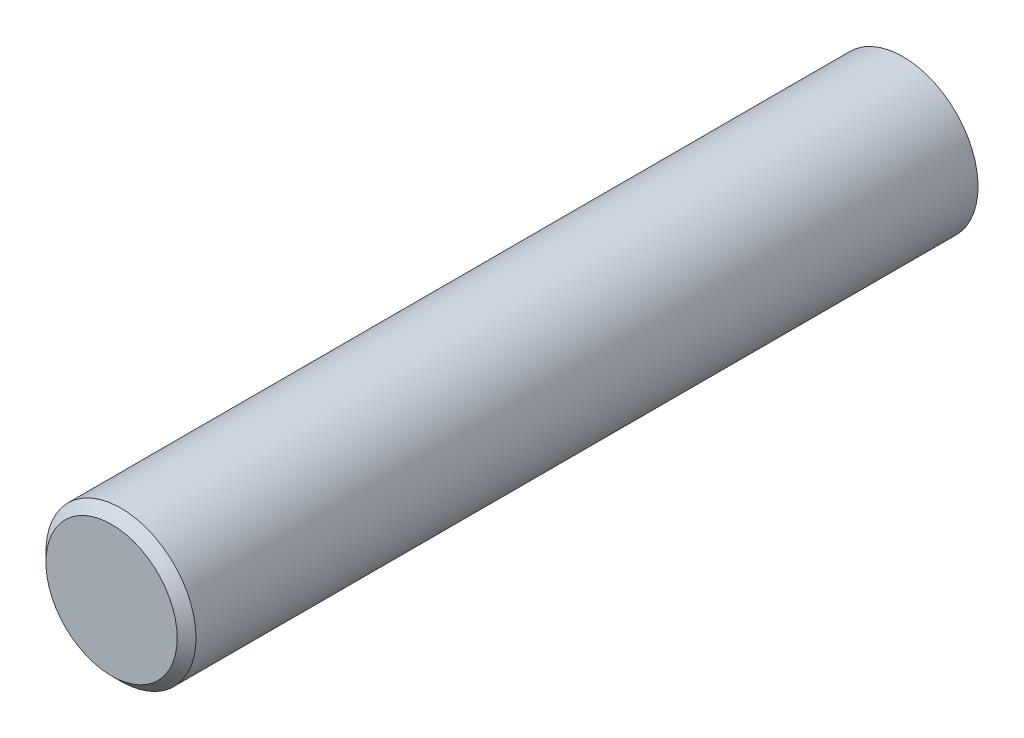
ISO-10303-21;
HEADER;
FILE_DESCRIPTION(('STEP AP214'),'2;1');
FILE_NAME('part.step','',(''),(''),'','','');
FILE_SCHEMA(('AUTOMOTIVE_DESIGN { 1 0 10303 214 1 1 1 1 }'));
ENDSEC;
DATA;
#1=APPLICATION_CONTEXT('core data for automotive mechanical design processes');
#2=APPLICATION_PROTOCOL_DEFINITION('international standard','automotive_design',2000,#1);
#3=PRODUCT_CONTEXT('',#1,'mechanical');
#4=PRODUCT('Part','Part','',(#3));
#5=PRODUCT_RELATED_PRODUCT_CATEGORY('part','',(#4));
#6=PRODUCT_DEFINITION_FORMATION('','',#4);
#7=PRODUCT_DEFINITION_CONTEXT('part definition',#1,'design');
#8=PRODUCT_DEFINITION('design','',#6,#7);
#9=PRODUCT_DEFINITION_SHAPE('','',#8);
#10=(LENGTH_UNIT() NAMED_UNIT(*) SI_UNIT(.MILLI.,.METRE.));
#11=(NAMED_UNIT(*) PLANE_ANGLE_UNIT() SI_UNIT($,.RADIAN.));
#12=(NAMED_UNIT(*) SI_UNIT($,.STERADIAN.) SOLID_ANGLE_UNIT());
#13=UNCERTAINTY_MEASURE_WITH_UNIT(LENGTH_MEASURE(1.E-05),#10,'distance_accuracy_value','');
#14=(GEOMETRIC_REPRESENTATION_CONTEXT(3) GLOBAL_UNCERTAINTY_ASSIGNED_CONTEXT((#13)) GLOBAL_UNIT_ASSIGNED_CONTEXT((#10,
#11,#12)) REPRESENTATION_CONTEXT('',''));
#15=CARTESIAN_POINT('',(0.,0.,0.));
#16=DIRECTION('',(0.,0.,1.));
#17=DIRECTION('',(1.,0.,0.));
#18=AXIS2_PLACEMENT_3D('',#15,#16,#17);
#19=CARTESIAN_POINT('',(0.,0.,30.));
#20=DIRECTION('',(0.,0.,-1.));
#21=DIRECTION('',(-1.,0.,0.));
#22=AXIS2_PLACEMENT_3D('',#19,#20,#21);
#23=CYLINDRICAL_SURFACE('',#22,4.);
#24=CARTESIAN_POINT('',(0.,0.,29.5));
#25=DIRECTION('',(0.,0.,1.));
#26=DIRECTION('',(1.,0.,0.));
#27=AXIS2_PLACEMENT_3D('',#24,#25,#26);
#28=CIRCLE('',#27,4.);
#29=CARTESIAN_POINT('',(4.,0.,29.5));
#30=VERTEX_POINT('',#29);
#31=EDGE_CURVE('E10',#30,#30,#28,.F.);
#32=ORIENTED_EDGE('',*,*,#31,.T.);
#33=EDGE_LOOP('',(#32));
#34=FACE_BOUND('',#33,.T.);
#35=CARTESIAN_POINT('',(0.,0.,-12.1982890120536));
#36=DIRECTION('',(0.,0.,1.));
#37=DIRECTION('',(0.,-1.,0.));
#38=AXIS2_PLACEMENT_3D('',#35,#36,#37);
#39=CIRCLE('',#38,4.);
#40=CARTESIAN_POINT('',(0.,-4.,-12.1982890120536));
#41=VERTEX_POINT('',#40);
#42=EDGE_CURVE('E41',#41,#41,#39,.F.);
#43=ORIENTED_EDGE('',*,*,#42,.F.);
#44=EDGE_LOOP('',(#43));
#45=FACE_BOUND('',#44,.T.);
#46=ADVANCED_FACE('F30',(#34,#45),#23,.T.);
#47=CARTESIAN_POINT('',(0.,0.,30.));
#48=DIRECTION('',(0.,0.,1.));
#49=DIRECTION('',(1.,0.,0.));
#50=AXIS2_PLACEMENT_3D('',#47,#48,#49);
#51=PLANE('',#50);
#52=CARTESIAN_POINT('',(0.,0.,30.));
#53=DIRECTION('',(0.,0.,1.));
#54=DIRECTION('',(1.,0.,0.));
#55=AXIS2_PLACEMENT_3D('',#52,#53,#54);
#56=CIRCLE('',#55,3.5);
#57=CARTESIAN_POINT('',(3.5,0.,30.));
#58=VERTEX_POINT('',#57);
#59=EDGE_CURVE('E37',#58,#58,#56,.T.);
#60=ORIENTED_EDGE('',*,*,#59,.T.);
#61=EDGE_LOOP('',(#60));
#62=FACE_BOUND('',#61,.T.);
#63=ADVANCED_FACE('F51',(#62),#51,.T.);
#64=CARTESIAN_POINT('',(-3.05867367228395E-12,-2.10118266616408E-12,-12.1982890120536));
#65=DIRECTION('',(0.,0.,1.));
#66=DIRECTION('',(-0.486007266191323,-0.873954768400079,0.));
#67=AXIS2_PLACEMENT_3D('',#64,#65,#66);
#68=PLANE('',#67);
#69=ORIENTED_EDGE('',*,*,#42,.T.);
#70=EDGE_LOOP('',(#69));
#71=FACE_BOUND('',#70,.T.);
#72=ADVANCED_FACE('F48',(#71),#68,.F.);
#73=CARTESIAN_POINT('',(0.,0.,30.));
#74=DIRECTION('',(0.,0.,-1.));
#75=DIRECTION('',(-1.,0.,0.));
#76=AXIS2_PLACEMENT_3D('',#73,#74,#75);
#77=CONICAL_SURFACE('',#76,3.5,0.785398163397451);
#78=ORIENTED_EDGE('',*,*,#31,.F.);
#79=EDGE_LOOP('',(#78));
#80=FACE_BOUND('',#79,.T.);
#81=ORIENTED_EDGE('',*,*,#59,.F.);
#82=EDGE_LOOP('',(#81));
#83=FACE_BOUND('',#82,.T.);
#84=ADVANCED_FACE('F32',(#80,#83),#77,.T.);
#85=CLOSED_SHELL('',(#46,#63,#72,#84));
#86=MANIFOLD_SOLID_BREP('B2',#85);
#87=ADVANCED_BREP_SHAPE_REPRESENTATION('',(#18,#86),#14);
#88=SHAPE_DEFINITION_REPRESENTATION(#9,#87);
ENDSEC;
END-ISO-10303-21;
